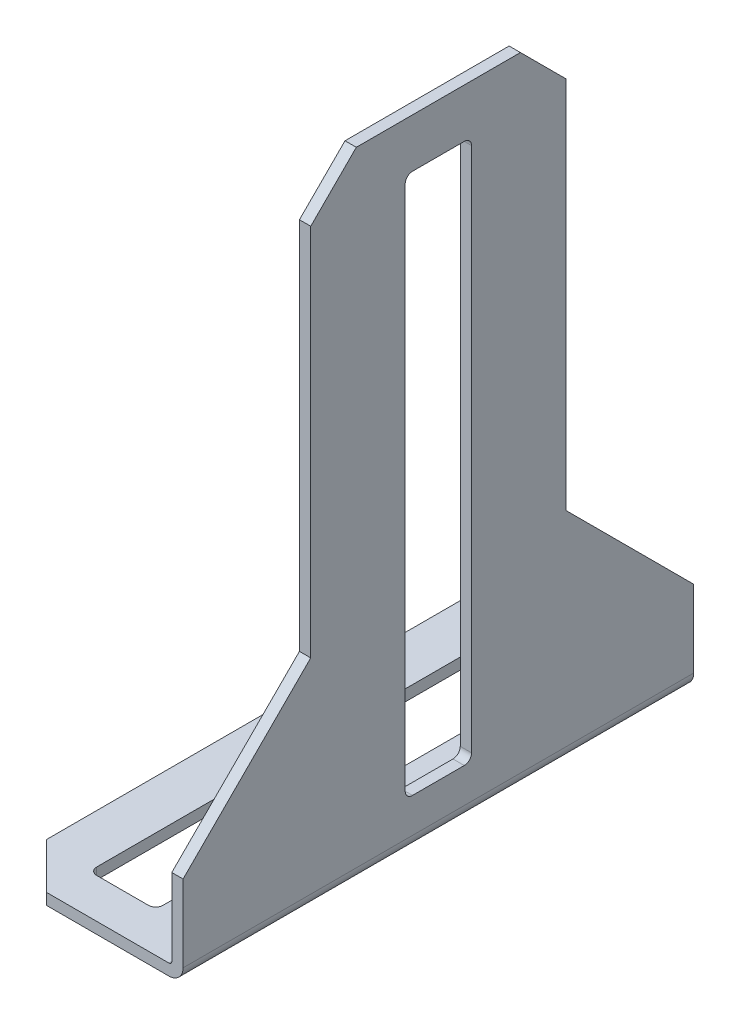
ISO-10303-21;
HEADER;
FILE_DESCRIPTION(('STEP AP214'),'2;1');
FILE_NAME('part.step','',(''),(''),'','','');
FILE_SCHEMA(('AUTOMOTIVE_DESIGN { 1 0 10303 214 1 1 1 1 }'));
ENDSEC;
DATA;
#1=APPLICATION_CONTEXT('core data for automotive mechanical design processes');
#2=APPLICATION_PROTOCOL_DEFINITION('international standard','automotive_design',2000,#1);
#3=PRODUCT_CONTEXT('',#1,'mechanical');
#4=PRODUCT('Part','Part','',(#3));
#5=PRODUCT_RELATED_PRODUCT_CATEGORY('part','',(#4));
#6=PRODUCT_DEFINITION_FORMATION('','',#4);
#7=PRODUCT_DEFINITION_CONTEXT('part definition',#1,'design');
#8=PRODUCT_DEFINITION('design','',#6,#7);
#9=PRODUCT_DEFINITION_SHAPE('','',#8);
#10=(LENGTH_UNIT() NAMED_UNIT(*) SI_UNIT(.MILLI.,.METRE.));
#11=(NAMED_UNIT(*) PLANE_ANGLE_UNIT() SI_UNIT($,.RADIAN.));
#12=(NAMED_UNIT(*) SI_UNIT($,.STERADIAN.) SOLID_ANGLE_UNIT());
#13=UNCERTAINTY_MEASURE_WITH_UNIT(LENGTH_MEASURE(1.E-05),#10,'distance_accuracy_value','');
#14=(GEOMETRIC_REPRESENTATION_CONTEXT(3) GLOBAL_UNCERTAINTY_ASSIGNED_CONTEXT((#13)) GLOBAL_UNIT_ASSIGNED_CONTEXT((#10,
#11,#12)) REPRESENTATION_CONTEXT('',''));
#15=CARTESIAN_POINT('',(0.,0.,0.));
#16=DIRECTION('',(0.,0.,1.));
#17=DIRECTION('',(1.,0.,0.));
#18=AXIS2_PLACEMENT_3D('',#15,#16,#17);
#19=CARTESIAN_POINT('',(3.9116,0.878660632863688,-14.5034));
#20=DIRECTION('',(0.,-1.,0.));
#21=DIRECTION('',(0.,0.,-1.));
#22=AXIS2_PLACEMENT_3D('',#19,#20,#21);
#23=CYLINDRICAL_SURFACE('',#22,0.508);
#24=CARTESIAN_POINT('',(3.9116,0.7874,-14.5034));
#25=DIRECTION('',(0.,-1.,0.));
#26=DIRECTION('',(0.,0.,-1.));
#27=AXIS2_PLACEMENT_3D('',#24,#25,#26);
#28=CIRCLE('',#27,0.508);
#29=CARTESIAN_POINT('',(3.4036,0.7874,-14.5034));
#30=VERTEX_POINT('',#29);
#31=CARTESIAN_POINT('',(3.9116,0.7874,-15.0114));
#32=VERTEX_POINT('',#31);
#33=EDGE_CURVE('E408',#30,#32,#28,.T.);
#34=ORIENTED_EDGE('',*,*,#33,.F.);
#35=DIRECTION('',(0.,1.,0.));
#36=VECTOR('',#35,1.);
#37=CARTESIAN_POINT('',(3.4036,0.7874,-14.5034));
#38=LINE('',#37,#36);
#39=CARTESIAN_POINT('',(3.4036,0.,-14.5034));
#40=VERTEX_POINT('',#39);
#41=EDGE_CURVE('E472',#30,#40,#38,.F.);
#42=ORIENTED_EDGE('',*,*,#41,.T.);
#43=CARTESIAN_POINT('',(3.9116,0.,-14.5034));
#44=DIRECTION('',(0.,-1.,0.));
#45=DIRECTION('',(0.,0.,-1.));
#46=AXIS2_PLACEMENT_3D('',#43,#44,#45);
#47=CIRCLE('',#46,0.508);
#48=CARTESIAN_POINT('',(3.9116,0.,-15.0114));
#49=VERTEX_POINT('',#48);
#50=EDGE_CURVE('E386',#49,#40,#47,.F.);
#51=ORIENTED_EDGE('',*,*,#50,.F.);
#52=DIRECTION('',(0.,1.,0.));
#53=VECTOR('',#52,1.);
#54=CARTESIAN_POINT('',(3.9116,0.7874,-15.0114));
#55=LINE('',#54,#53);
#56=EDGE_CURVE('E456',#49,#32,#55,.T.);
#57=ORIENTED_EDGE('',*,*,#56,.T.);
#58=EDGE_LOOP('',(#34,#42,#51,#57));
#59=FACE_BOUND('',#58,.T.);
#60=ADVANCED_FACE('F15',(#59),#23,.F.);
#61=CARTESIAN_POINT('',(3.4036,0.7874,-15.0114));
#62=DIRECTION('',(-1.,0.,0.));
#63=DIRECTION('',(0.,0.,1.));
#64=AXIS2_PLACEMENT_3D('',#61,#62,#63);
#65=PLANE('',#64);
#66=DIRECTION('',(0.,0.,-1.));
#67=VECTOR('',#66,1.);
#68=CARTESIAN_POINT('',(3.4036,0.,-17.78));
#69=LINE('',#68,#67);
#70=CARTESIAN_POINT('',(3.4036,0.,14.5034));
#71=VERTEX_POINT('',#70);
#72=EDGE_CURVE('E383',#40,#71,#69,.F.);
#73=ORIENTED_EDGE('',*,*,#72,.F.);
#74=ORIENTED_EDGE('',*,*,#41,.F.);
#75=DIRECTION('',(0.,0.,1.));
#76=VECTOR('',#75,1.);
#77=CARTESIAN_POINT('',(3.4036,0.7874,-17.78));
#78=LINE('',#77,#76);
#79=CARTESIAN_POINT('',(3.4036,0.7874,14.5034));
#80=VERTEX_POINT('',#79);
#81=EDGE_CURVE('E392',#80,#30,#78,.F.);
#82=ORIENTED_EDGE('',*,*,#81,.F.);
#83=DIRECTION('',(0.,-1.,0.));
#84=VECTOR('',#83,1.);
#85=CARTESIAN_POINT('',(3.4036,0.878660632863688,14.5034));
#86=LINE('',#85,#84);
#87=EDGE_CURVE('E470',#80,#71,#86,.T.);
#88=ORIENTED_EDGE('',*,*,#87,.T.);
#89=EDGE_LOOP('',(#73,#74,#82,#88));
#90=FACE_BOUND('',#89,.T.);
#91=ADVANCED_FACE('F806',(#90),#65,.F.);
#92=CARTESIAN_POINT('',(3.9116,0.878660632863688,14.5034));
#93=DIRECTION('',(0.,-1.,0.));
#94=DIRECTION('',(0.,0.,-1.));
#95=AXIS2_PLACEMENT_3D('',#92,#93,#94);
#96=CYLINDRICAL_SURFACE('',#95,0.508);
#97=CARTESIAN_POINT('',(3.9116,0.7874,14.5034));
#98=DIRECTION('',(0.,-1.,0.));
#99=DIRECTION('',(0.,0.,-1.));
#100=AXIS2_PLACEMENT_3D('',#97,#98,#99);
#101=CIRCLE('',#100,0.508);
#102=CARTESIAN_POINT('',(3.9116,0.7874,15.0114));
#103=VERTEX_POINT('',#102);
#104=EDGE_CURVE('E396',#103,#80,#101,.T.);
#105=ORIENTED_EDGE('',*,*,#104,.F.);
#106=DIRECTION('',(0.,1.,0.));
#107=VECTOR('',#106,1.);
#108=CARTESIAN_POINT('',(3.9116,0.7874,15.0114));
#109=LINE('',#108,#107);
#110=CARTESIAN_POINT('',(3.9116,0.,15.0114));
#111=VERTEX_POINT('',#110);
#112=EDGE_CURVE('E468',#103,#111,#109,.F.);
#113=ORIENTED_EDGE('',*,*,#112,.T.);
#114=CARTESIAN_POINT('',(3.9116,0.,14.5034));
#115=DIRECTION('',(0.,-1.,0.));
#116=DIRECTION('',(0.,0.,-1.));
#117=AXIS2_PLACEMENT_3D('',#114,#115,#116);
#118=CIRCLE('',#117,0.508);
#119=EDGE_CURVE('E382',#71,#111,#118,.F.);
#120=ORIENTED_EDGE('',*,*,#119,.F.);
#121=ORIENTED_EDGE('',*,*,#87,.F.);
#122=EDGE_LOOP('',(#105,#113,#120,#121));
#123=FACE_BOUND('',#122,.T.);
#124=ADVANCED_FACE('F798',(#123),#96,.F.);
#125=CARTESIAN_POINT('',(3.4036,0.7874,15.0114));
#126=DIRECTION('',(0.,0.,1.));
#127=DIRECTION('',(1.,0.,0.));
#128=AXIS2_PLACEMENT_3D('',#125,#126,#127);
#129=PLANE('',#128);
#130=DIRECTION('',(1.,0.,0.));
#131=VECTOR('',#130,1.);
#132=CARTESIAN_POINT('',(0.,0.,15.0114));
#133=LINE('',#132,#131);
#134=CARTESIAN_POINT('',(7.5184,0.,15.0114));
#135=VERTEX_POINT('',#134);
#136=EDGE_CURVE('E379',#111,#135,#133,.T.);
#137=ORIENTED_EDGE('',*,*,#136,.F.);
#138=ORIENTED_EDGE('',*,*,#112,.F.);
#139=DIRECTION('',(1.,0.,0.));
#140=VECTOR('',#139,1.);
#141=CARTESIAN_POINT('',(11.9126,0.7874,15.0114));
#142=LINE('',#141,#140);
#143=CARTESIAN_POINT('',(7.5184,0.7874,15.0114));
#144=VERTEX_POINT('',#143);
#145=EDGE_CURVE('E397',#144,#103,#142,.F.);
#146=ORIENTED_EDGE('',*,*,#145,.F.);
#147=DIRECTION('',(0.,-1.,0.));
#148=VECTOR('',#147,1.);
#149=CARTESIAN_POINT('',(7.5184,0.878660632863688,15.0114));
#150=LINE('',#149,#148);
#151=EDGE_CURVE('E466',#144,#135,#150,.T.);
#152=ORIENTED_EDGE('',*,*,#151,.T.);
#153=EDGE_LOOP('',(#137,#138,#146,#152));
#154=FACE_BOUND('',#153,.T.);
#155=ADVANCED_FACE('F790',(#154),#129,.F.);
#156=CARTESIAN_POINT('',(7.5184,0.878660632863688,14.5034));
#157=DIRECTION('',(0.,-1.,0.));
#158=DIRECTION('',(0.,0.,-1.));
#159=AXIS2_PLACEMENT_3D('',#156,#157,#158);
#160=CYLINDRICAL_SURFACE('',#159,0.508);
#161=CARTESIAN_POINT('',(7.5184,0.7874,14.5034));
#162=DIRECTION('',(0.,-1.,0.));
#163=DIRECTION('',(0.,0.,-1.));
#164=AXIS2_PLACEMENT_3D('',#161,#162,#163);
#165=CIRCLE('',#164,0.508);
#166=CARTESIAN_POINT('',(8.0264,0.7874,14.5034));
#167=VERTEX_POINT('',#166);
#168=EDGE_CURVE('E400',#167,#144,#165,.T.);
#169=ORIENTED_EDGE('',*,*,#168,.F.);
#170=DIRECTION('',(0.,1.,0.));
#171=VECTOR('',#170,1.);
#172=CARTESIAN_POINT('',(8.0264,0.7874,14.5034));
#173=LINE('',#172,#171);
#174=CARTESIAN_POINT('',(8.0264,0.,14.5034));
#175=VERTEX_POINT('',#174);
#176=EDGE_CURVE('E464',#167,#175,#173,.F.);
#177=ORIENTED_EDGE('',*,*,#176,.T.);
#178=CARTESIAN_POINT('',(7.5184,0.,14.5034));
#179=DIRECTION('',(0.,-1.,0.));
#180=DIRECTION('',(0.,0.,-1.));
#181=AXIS2_PLACEMENT_3D('',#178,#179,#180);
#182=CIRCLE('',#181,0.508);
#183=EDGE_CURVE('E378',#135,#175,#182,.F.);
#184=ORIENTED_EDGE('',*,*,#183,.F.);
#185=ORIENTED_EDGE('',*,*,#151,.F.);
#186=EDGE_LOOP('',(#169,#177,#184,#185));
#187=FACE_BOUND('',#186,.T.);
#188=ADVANCED_FACE('F782',(#187),#160,.F.);
#189=CARTESIAN_POINT('',(8.0264,0.7874,15.0114));
#190=DIRECTION('',(1.,0.,0.));
#191=DIRECTION('',(0.,0.,-1.));
#192=AXIS2_PLACEMENT_3D('',#189,#190,#191);
#193=PLANE('',#192);
#194=DIRECTION('',(0.,0.,1.));
#195=VECTOR('',#194,1.);
#196=CARTESIAN_POINT('',(8.0264,0.7874,-17.78));
#197=LINE('',#196,#195);
#198=CARTESIAN_POINT('',(8.0264,0.7874,-14.5034));
#199=VERTEX_POINT('',#198);
#200=EDGE_CURVE('E401',#199,#167,#197,.T.);
#201=ORIENTED_EDGE('',*,*,#200,.F.);
#202=DIRECTION('',(0.,-1.,0.));
#203=VECTOR('',#202,1.);
#204=CARTESIAN_POINT('',(8.0264,0.878660632863688,-14.5034));
#205=LINE('',#204,#203);
#206=CARTESIAN_POINT('',(8.0264,0.,-14.5034));
#207=VERTEX_POINT('',#206);
#208=EDGE_CURVE('E461',#199,#207,#205,.T.);
#209=ORIENTED_EDGE('',*,*,#208,.T.);
#210=DIRECTION('',(0.,0.,-1.));
#211=VECTOR('',#210,1.);
#212=CARTESIAN_POINT('',(8.0264,0.,-17.78));
#213=LINE('',#212,#211);
#214=EDGE_CURVE('E375',#175,#207,#213,.T.);
#215=ORIENTED_EDGE('',*,*,#214,.F.);
#216=ORIENTED_EDGE('',*,*,#176,.F.);
#217=EDGE_LOOP('',(#201,#209,#215,#216));
#218=FACE_BOUND('',#217,.T.);
#219=ADVANCED_FACE('F774',(#218),#193,.F.);
#220=CARTESIAN_POINT('',(7.5184,0.878660632863688,-14.5034));
#221=DIRECTION('',(0.,-1.,0.));
#222=DIRECTION('',(0.,0.,-1.));
#223=AXIS2_PLACEMENT_3D('',#220,#221,#222);
#224=CYLINDRICAL_SURFACE('',#223,0.508);
#225=CARTESIAN_POINT('',(7.5184,0.7874,-14.5034));
#226=DIRECTION('',(0.,-1.,0.));
#227=DIRECTION('',(0.,0.,-1.));
#228=AXIS2_PLACEMENT_3D('',#225,#226,#227);
#229=CIRCLE('',#228,0.508);
#230=CARTESIAN_POINT('',(7.5184,0.7874,-15.0114));
#231=VERTEX_POINT('',#230);
#232=EDGE_CURVE('E404',#231,#199,#229,.T.);
#233=ORIENTED_EDGE('',*,*,#232,.F.);
#234=DIRECTION('',(0.,1.,0.));
#235=VECTOR('',#234,1.);
#236=CARTESIAN_POINT('',(7.5184,0.7874,-15.0114));
#237=LINE('',#236,#235);
#238=CARTESIAN_POINT('',(7.5184,0.,-15.0114));
#239=VERTEX_POINT('',#238);
#240=EDGE_CURVE('E459',#231,#239,#237,.F.);
#241=ORIENTED_EDGE('',*,*,#240,.T.);
#242=CARTESIAN_POINT('',(7.5184,0.,-14.5034));
#243=DIRECTION('',(0.,-1.,0.));
#244=DIRECTION('',(0.,0.,-1.));
#245=AXIS2_PLACEMENT_3D('',#242,#243,#244);
#246=CIRCLE('',#245,0.508);
#247=EDGE_CURVE('E374',#207,#239,#246,.F.);
#248=ORIENTED_EDGE('',*,*,#247,.F.);
#249=ORIENTED_EDGE('',*,*,#208,.F.);
#250=EDGE_LOOP('',(#233,#241,#248,#249));
#251=FACE_BOUND('',#250,.T.);
#252=ADVANCED_FACE('F766',(#251),#224,.F.);
#253=CARTESIAN_POINT('',(8.0264,0.7874,-15.0114));
#254=DIRECTION('',(0.,0.,-1.));
#255=DIRECTION('',(-1.,0.,0.));
#256=AXIS2_PLACEMENT_3D('',#253,#254,#255);
#257=PLANE('',#256);
#258=DIRECTION('',(1.,0.,0.));
#259=VECTOR('',#258,1.);
#260=CARTESIAN_POINT('',(0.,0.,-15.0114));
#261=LINE('',#260,#259);
#262=EDGE_CURVE('E370',#239,#49,#261,.F.);
#263=ORIENTED_EDGE('',*,*,#262,.F.);
#264=ORIENTED_EDGE('',*,*,#240,.F.);
#265=DIRECTION('',(1.,0.,0.));
#266=VECTOR('',#265,1.);
#267=CARTESIAN_POINT('',(11.9126,0.7874,-15.0114));
#268=LINE('',#267,#266);
#269=EDGE_CURVE('E405',#32,#231,#268,.T.);
#270=ORIENTED_EDGE('',*,*,#269,.F.);
#271=ORIENTED_EDGE('',*,*,#56,.F.);
#272=EDGE_LOOP('',(#263,#264,#270,#271));
#273=FACE_BOUND('',#272,.T.);
#274=ADVANCED_FACE('F758',(#273),#257,.F.);
#275=CARTESIAN_POINT('',(0.,0.7874,-17.78));
#276=DIRECTION('',(-1.,0.,0.));
#277=DIRECTION('',(0.,0.,1.));
#278=AXIS2_PLACEMENT_3D('',#275,#276,#277);
#279=PLANE('',#278);
#280=DIRECTION('',(0.,0.,-1.));
#281=VECTOR('',#280,1.);
#282=CARTESIAN_POINT('',(0.,0.,-17.78));
#283=LINE('',#282,#281);
#284=CARTESIAN_POINT('',(0.,0.,14.605));
#285=VERTEX_POINT('',#284);
#286=CARTESIAN_POINT('',(0.,0.,-14.605));
#287=VERTEX_POINT('',#286);
#288=EDGE_CURVE('E373',#285,#287,#283,.T.);
#289=ORIENTED_EDGE('',*,*,#288,.F.);
#290=DIRECTION('',(0.,1.,0.));
#291=VECTOR('',#290,1.);
#292=CARTESIAN_POINT('',(0.,0.3937,14.605));
#293=LINE('',#292,#291);
#294=CARTESIAN_POINT('',(0.,0.7874,14.605));
#295=VERTEX_POINT('',#294);
#296=EDGE_CURVE('E439',#295,#285,#293,.F.);
#297=ORIENTED_EDGE('',*,*,#296,.F.);
#298=DIRECTION('',(0.,0.,1.));
#299=VECTOR('',#298,1.);
#300=CARTESIAN_POINT('',(0.,0.7874,-17.78));
#301=LINE('',#300,#299);
#302=CARTESIAN_POINT('',(0.,0.7874,-14.605));
#303=VERTEX_POINT('',#302);
#304=EDGE_CURVE('E413',#303,#295,#301,.T.);
#305=ORIENTED_EDGE('',*,*,#304,.F.);
#306=DIRECTION('',(0.,1.,0.));
#307=VECTOR('',#306,1.);
#308=CARTESIAN_POINT('',(0.,0.3937,-14.605));
#309=LINE('',#308,#307);
#310=EDGE_CURVE('E452',#287,#303,#309,.T.);
#311=ORIENTED_EDGE('',*,*,#310,.F.);
#312=EDGE_LOOP('',(#289,#297,#305,#311));
#313=FACE_BOUND('',#312,.T.);
#314=ADVANCED_FACE('F750',(#313),#279,.T.);
#315=CARTESIAN_POINT('',(1.5875,0.3937,-16.1925));
#316=DIRECTION('',(-0.707106781186548,0.,-0.707106781186548));
#317=DIRECTION('',(-0.707106781186548,0.,0.707106781186548));
#318=AXIS2_PLACEMENT_3D('',#315,#316,#317);
#319=PLANE('',#318);
#320=DIRECTION('',(0.,1.,0.));
#321=VECTOR('',#320,1.);
#322=CARTESIAN_POINT('',(3.175,0.3937,-17.78));
#323=LINE('',#322,#321);
#324=CARTESIAN_POINT('',(3.175,0.7874,-17.78));
#325=VERTEX_POINT('',#324);
#326=CARTESIAN_POINT('',(3.175,0.,-17.78));
#327=VERTEX_POINT('',#326);
#328=EDGE_CURVE('E444',#325,#327,#323,.F.);
#329=ORIENTED_EDGE('',*,*,#328,.T.);
#330=DIRECTION('',(0.707106781186547,0.,-0.707106781186548));
#331=VECTOR('',#330,1.);
#332=CARTESIAN_POINT('',(0.,0.,-14.605));
#333=LINE('',#332,#331);
#334=EDGE_CURVE('E387',#287,#327,#333,.T.);
#335=ORIENTED_EDGE('',*,*,#334,.F.);
#336=ORIENTED_EDGE('',*,*,#310,.T.);
#337=DIRECTION('',(-0.707106781186547,0.,0.707106781186548));
#338=VECTOR('',#337,1.);
#339=CARTESIAN_POINT('',(3.175,0.7874,-17.78));
#340=LINE('',#339,#338);
#341=EDGE_CURVE('E395',#325,#303,#340,.T.);
#342=ORIENTED_EDGE('',*,*,#341,.F.);
#343=EDGE_LOOP('',(#329,#335,#336,#342));
#344=FACE_BOUND('',#343,.T.);
#345=ADVANCED_FACE('F743',(#344),#319,.T.);
#346=CARTESIAN_POINT('',(1.5875,0.3937,16.1925));
#347=DIRECTION('',(-0.707106781186548,0.,0.707106781186548));
#348=DIRECTION('',(0.707106781186548,0.,0.707106781186548));
#349=AXIS2_PLACEMENT_3D('',#346,#347,#348);
#350=PLANE('',#349);
#351=DIRECTION('',(0.,1.,0.));
#352=VECTOR('',#351,1.);
#353=CARTESIAN_POINT('',(3.175,0.3937,17.78));
#354=LINE('',#353,#352);
#355=CARTESIAN_POINT('',(3.175,0.,17.78));
#356=VERTEX_POINT('',#355);
#357=CARTESIAN_POINT('',(3.175,0.7874,17.78));
#358=VERTEX_POINT('',#357);
#359=EDGE_CURVE('E232',#356,#358,#354,.T.);
#360=ORIENTED_EDGE('',*,*,#359,.T.);
#361=DIRECTION('',(0.707106781186549,0.,0.707106781186546));
#362=VECTOR('',#361,1.);
#363=CARTESIAN_POINT('',(0.,0.7874,14.605));
#364=LINE('',#363,#362);
#365=EDGE_CURVE('E410',#295,#358,#364,.T.);
#366=ORIENTED_EDGE('',*,*,#365,.F.);
#367=ORIENTED_EDGE('',*,*,#296,.T.);
#368=DIRECTION('',(-0.707106781186548,0.,-0.707106781186547));
#369=VECTOR('',#368,1.);
#370=CARTESIAN_POINT('',(3.175,0.,17.78));
#371=LINE('',#370,#369);
#372=EDGE_CURVE('E242',#356,#285,#371,.T.);
#373=ORIENTED_EDGE('',*,*,#372,.F.);
#374=EDGE_LOOP('',(#360,#366,#367,#373));
#375=FACE_BOUND('',#374,.T.);
#376=ADVANCED_FACE('F529',(#375),#350,.T.);
#377=CARTESIAN_POINT('',(11.7094,0.9906,-17.8579774517918));
#378=DIRECTION('',(0.,0.,1.));
#379=DIRECTION('',(1.,0.,0.));
#380=AXIS2_PLACEMENT_3D('',#377,#378,#379);
#381=CYLINDRICAL_SURFACE('',#380,0.203200000000001);
#382=CARTESIAN_POINT('',(11.7094,0.9906,-17.78));
#383=DIRECTION('',(0.,0.,1.));
#384=DIRECTION('',(1.,0.,0.));
#385=AXIS2_PLACEMENT_3D('',#382,#383,#384);
#386=CIRCLE('',#385,0.203200000000001);
#387=CARTESIAN_POINT('',(11.7094,0.7874,-17.78));
#388=VERTEX_POINT('',#387);
#389=CARTESIAN_POINT('',(11.9126,0.990600000000001,-17.78));
#390=VERTEX_POINT('',#389);
#391=EDGE_CURVE('E231',#388,#390,#386,.T.);
#392=ORIENTED_EDGE('',*,*,#391,.F.);
#393=DIRECTION('',(0.,0.,1.));
#394=VECTOR('',#393,1.);
#395=CARTESIAN_POINT('',(11.7094,0.7874,-17.78));
#396=LINE('',#395,#394);
#397=CARTESIAN_POINT('',(11.7094,0.7874,17.78));
#398=VERTEX_POINT('',#397);
#399=EDGE_CURVE('E226',#398,#388,#396,.F.);
#400=ORIENTED_EDGE('',*,*,#399,.F.);
#401=CARTESIAN_POINT('',(11.7094,0.9906,17.78));
#402=DIRECTION('',(0.,0.,1.));
#403=DIRECTION('',(1.,0.,0.));
#404=AXIS2_PLACEMENT_3D('',#401,#402,#403);
#405=CIRCLE('',#404,0.203200000000001);
#406=CARTESIAN_POINT('',(11.9126,0.990600000000001,17.78));
#407=VERTEX_POINT('',#406);
#408=EDGE_CURVE('E18',#407,#398,#405,.F.);
#409=ORIENTED_EDGE('',*,*,#408,.F.);
#410=DIRECTION('',(0.,0.,1.));
#411=VECTOR('',#410,1.);
#412=CARTESIAN_POINT('',(11.9126,0.990600000000001,-17.78));
#413=LINE('',#412,#411);
#414=EDGE_CURVE('E223',#390,#407,#413,.T.);
#415=ORIENTED_EDGE('',*,*,#414,.F.);
#416=EDGE_LOOP('',(#392,#400,#409,#415));
#417=FACE_BOUND('',#416,.T.);
#418=ADVANCED_FACE('F222',(#417),#381,.F.);
#419=CARTESIAN_POINT('',(11.9126,0.7874,-17.78));
#420=DIRECTION('',(0.,1.,0.));
#421=DIRECTION('',(0.,0.,1.));
#422=AXIS2_PLACEMENT_3D('',#419,#420,#421);
#423=PLANE('',#422);
#424=DIRECTION('',(1.,0.,0.));
#425=VECTOR('',#424,1.);
#426=CARTESIAN_POINT('',(0.,0.7874,17.78));
#427=LINE('',#426,#425);
#428=EDGE_CURVE('E262',#398,#358,#427,.F.);
#429=ORIENTED_EDGE('',*,*,#428,.F.);
#430=ORIENTED_EDGE('',*,*,#399,.T.);
#431=DIRECTION('',(1.,0.,0.));
#432=VECTOR('',#431,1.);
#433=CARTESIAN_POINT('',(0.,0.7874,-17.78));
#434=LINE('',#433,#432);
#435=EDGE_CURVE('E497',#388,#325,#434,.F.);
#436=ORIENTED_EDGE('',*,*,#435,.T.);
#437=ORIENTED_EDGE('',*,*,#341,.T.);
#438=ORIENTED_EDGE('',*,*,#304,.T.);
#439=ORIENTED_EDGE('',*,*,#365,.T.);
#440=EDGE_LOOP('',(#429,#430,#436,#437,#438,#439));
#441=FACE_BOUND('',#440,.T.);
#442=ORIENTED_EDGE('',*,*,#104,.T.);
#443=ORIENTED_EDGE('',*,*,#81,.T.);
#444=ORIENTED_EDGE('',*,*,#33,.T.);
#445=ORIENTED_EDGE('',*,*,#269,.T.);
#446=ORIENTED_EDGE('',*,*,#232,.T.);
#447=ORIENTED_EDGE('',*,*,#200,.T.);
#448=ORIENTED_EDGE('',*,*,#168,.T.);
#449=ORIENTED_EDGE('',*,*,#145,.T.);
#450=EDGE_LOOP('',(#442,#443,#444,#445,#446,#447,#448,#449));
#451=FACE_BOUND('',#450,.T.);
#452=ADVANCED_FACE('F523',(#441,#451),#423,.T.);
#453=CARTESIAN_POINT('',(0.,0.,-17.78));
#454=DIRECTION('',(0.,-1.,0.));
#455=DIRECTION('',(0.,0.,-1.));
#456=AXIS2_PLACEMENT_3D('',#453,#454,#455);
#457=PLANE('',#456);
#458=DIRECTION('',(1.,0.,0.));
#459=VECTOR('',#458,1.);
#460=CARTESIAN_POINT('',(0.,0.,17.78));
#461=LINE('',#460,#459);
#462=CARTESIAN_POINT('',(11.7094,0.,17.78));
#463=VERTEX_POINT('',#462);
#464=EDGE_CURVE('E252',#356,#463,#461,.T.);
#465=ORIENTED_EDGE('',*,*,#464,.F.);
#466=ORIENTED_EDGE('',*,*,#372,.T.);
#467=ORIENTED_EDGE('',*,*,#288,.T.);
#468=ORIENTED_EDGE('',*,*,#334,.T.);
#469=DIRECTION('',(1.,0.,0.));
#470=VECTOR('',#469,1.);
#471=CARTESIAN_POINT('',(0.,0.,-17.78));
#472=LINE('',#471,#470);
#473=CARTESIAN_POINT('',(11.7094,0.,-17.78));
#474=VERTEX_POINT('',#473);
#475=EDGE_CURVE('E494',#327,#474,#472,.T.);
#476=ORIENTED_EDGE('',*,*,#475,.T.);
#477=DIRECTION('',(0.,0.,-1.));
#478=VECTOR('',#477,1.);
#479=CARTESIAN_POINT('',(11.7094,0.,17.8712606328632));
#480=LINE('',#479,#478);
#481=EDGE_CURVE('E247',#463,#474,#480,.T.);
#482=ORIENTED_EDGE('',*,*,#481,.F.);
#483=EDGE_LOOP('',(#465,#466,#467,#468,#476,#482));
#484=FACE_BOUND('',#483,.T.);
#485=ORIENTED_EDGE('',*,*,#247,.T.);
#486=ORIENTED_EDGE('',*,*,#262,.T.);
#487=ORIENTED_EDGE('',*,*,#50,.T.);
#488=ORIENTED_EDGE('',*,*,#72,.T.);
#489=ORIENTED_EDGE('',*,*,#119,.T.);
#490=ORIENTED_EDGE('',*,*,#136,.T.);
#491=ORIENTED_EDGE('',*,*,#183,.T.);
#492=ORIENTED_EDGE('',*,*,#214,.T.);
#493=EDGE_LOOP('',(#485,#486,#487,#488,#489,#490,#491,#492));
#494=FACE_BOUND('',#493,.T.);
#495=ADVANCED_FACE('F531',(#484,#494),#457,.T.);
#496=CARTESIAN_POINT('',(11.9126,44.45,-17.78));
#497=DIRECTION('',(-1.,0.,0.));
#498=DIRECTION('',(0.,0.,1.));
#499=AXIS2_PLACEMENT_3D('',#496,#497,#498);
#500=PLANE('',#499);
#501=DIRECTION('',(0.,1.,0.));
#502=VECTOR('',#501,1.);
#503=CARTESIAN_POINT('',(11.9126,0.,17.78));
#504=LINE('',#503,#502);
#505=CARTESIAN_POINT('',(11.9126,6.35,17.78));
#506=VERTEX_POINT('',#505);
#507=EDGE_CURVE('E237',#506,#407,#504,.F.);
#508=ORIENTED_EDGE('',*,*,#507,.F.);
#509=DIRECTION('',(0.,0.707106781186548,-0.707106781186548));
#510=VECTOR('',#509,1.);
#511=CARTESIAN_POINT('',(11.9126,6.35,17.78));
#512=LINE('',#511,#510);
#513=CARTESIAN_POINT('',(11.9126,15.24,8.89));
#514=VERTEX_POINT('',#513);
#515=EDGE_CURVE('E279',#506,#514,#512,.T.);
#516=ORIENTED_EDGE('',*,*,#515,.T.);
#517=DIRECTION('',(0.,1.,0.));
#518=VECTOR('',#517,1.);
#519=CARTESIAN_POINT('',(11.9126,15.24,8.89));
#520=LINE('',#519,#518);
#521=CARTESIAN_POINT('',(11.9126,41.275,8.89));
#522=VERTEX_POINT('',#521);
#523=EDGE_CURVE('E289',#514,#522,#520,.T.);
#524=ORIENTED_EDGE('',*,*,#523,.T.);
#525=DIRECTION('',(0.,-0.707106781186548,0.707106781186548));
#526=VECTOR('',#525,1.);
#527=CARTESIAN_POINT('',(11.9126,42.8625,7.3025));
#528=LINE('',#527,#526);
#529=CARTESIAN_POINT('',(11.9126,44.45,5.715));
#530=VERTEX_POINT('',#529);
#531=EDGE_CURVE('E300',#530,#522,#528,.T.);
#532=ORIENTED_EDGE('',*,*,#531,.F.);
#533=DIRECTION('',(0.,0.,1.));
#534=VECTOR('',#533,1.);
#535=CARTESIAN_POINT('',(11.9126,44.45,-17.78));
#536=LINE('',#535,#534);
#537=CARTESIAN_POINT('',(11.9126,44.45,-5.715));
#538=VERTEX_POINT('',#537);
#539=EDGE_CURVE('E301',#538,#530,#536,.T.);
#540=ORIENTED_EDGE('',*,*,#539,.F.);
#541=DIRECTION('',(0.,0.707106781186548,0.707106781186548));
#542=VECTOR('',#541,1.);
#543=CARTESIAN_POINT('',(11.9126,42.8625,-7.3025));
#544=LINE('',#543,#542);
#545=CARTESIAN_POINT('',(11.9126,41.275,-8.89));
#546=VERTEX_POINT('',#545);
#547=EDGE_CURVE('E313',#546,#538,#544,.T.);
#548=ORIENTED_EDGE('',*,*,#547,.F.);
#549=DIRECTION('',(0.,1.,0.));
#550=VECTOR('',#549,1.);
#551=CARTESIAN_POINT('',(11.9126,44.45,-8.89));
#552=LINE('',#551,#550);
#553=CARTESIAN_POINT('',(11.9126,15.24,-8.89));
#554=VERTEX_POINT('',#553);
#555=EDGE_CURVE('E353',#546,#554,#552,.F.);
#556=ORIENTED_EDGE('',*,*,#555,.T.);
#557=DIRECTION('',(0.,-0.707106781186548,-0.707106781186548));
#558=VECTOR('',#557,1.);
#559=CARTESIAN_POINT('',(11.9126,15.24,-8.89));
#560=LINE('',#559,#558);
#561=CARTESIAN_POINT('',(11.9126,6.35,-17.78));
#562=VERTEX_POINT('',#561);
#563=EDGE_CURVE('E363',#554,#562,#560,.T.);
#564=ORIENTED_EDGE('',*,*,#563,.T.);
#565=DIRECTION('',(0.,1.,0.));
#566=VECTOR('',#565,1.);
#567=CARTESIAN_POINT('',(11.9126,0.,-17.78));
#568=LINE('',#567,#566);
#569=EDGE_CURVE('E240',#562,#390,#568,.F.);
#570=ORIENTED_EDGE('',*,*,#569,.T.);
#571=ORIENTED_EDGE('',*,*,#414,.T.);
#572=EDGE_LOOP('',(#508,#516,#524,#532,#540,#548,#556,#564,#570,#571));
#573=FACE_BOUND('',#572,.T.);
#574=CARTESIAN_POINT('',(11.9126,3.9116,1.8034));
#575=DIRECTION('',(1.,0.,0.));
#576=DIRECTION('',(0.,0.,-1.));
#577=AXIS2_PLACEMENT_3D('',#574,#575,#576);
#578=CIRCLE('',#577,0.508);
#579=CARTESIAN_POINT('',(11.9126,3.9116,2.3114));
#580=VERTEX_POINT('',#579);
#581=CARTESIAN_POINT('',(11.9126,3.4036,1.8034));
#582=VERTEX_POINT('',#581);
#583=EDGE_CURVE('E338',#580,#582,#578,.T.);
#584=ORIENTED_EDGE('',*,*,#583,.T.);
#585=DIRECTION('',(0.,0.,-1.));
#586=VECTOR('',#585,1.);
#587=CARTESIAN_POINT('',(11.9126,3.4036,-2.3114));
#588=LINE('',#587,#586);
#589=CARTESIAN_POINT('',(11.9126,3.4036,-1.8034));
#590=VERTEX_POINT('',#589);
#591=EDGE_CURVE('E341',#582,#590,#588,.T.);
#592=ORIENTED_EDGE('',*,*,#591,.T.);
#593=CARTESIAN_POINT('',(11.9126,3.9116,-1.8034));
#594=DIRECTION('',(1.,0.,0.));
#595=DIRECTION('',(0.,0.,-1.));
#596=AXIS2_PLACEMENT_3D('',#593,#594,#595);
#597=CIRCLE('',#596,0.508);
#598=CARTESIAN_POINT('',(11.9126,3.9116,-2.3114));
#599=VERTEX_POINT('',#598);
#600=EDGE_CURVE('E241',#590,#599,#597,.T.);
#601=ORIENTED_EDGE('',*,*,#600,.T.);
#602=DIRECTION('',(0.,1.,0.));
#603=VECTOR('',#602,1.);
#604=CARTESIAN_POINT('',(11.9126,41.0464,-2.3114));
#605=LINE('',#604,#603);
#606=CARTESIAN_POINT('',(11.9126,40.5384,-2.3114));
#607=VERTEX_POINT('',#606);
#608=EDGE_CURVE('E321',#599,#607,#605,.T.);
#609=ORIENTED_EDGE('',*,*,#608,.T.);
#610=CARTESIAN_POINT('',(11.9126,40.5384,-1.8034));
#611=DIRECTION('',(1.,0.,0.));
#612=DIRECTION('',(0.,0.,-1.));
#613=AXIS2_PLACEMENT_3D('',#610,#611,#612);
#614=CIRCLE('',#613,0.508);
#615=CARTESIAN_POINT('',(11.9126,41.0464,-1.8034));
#616=VERTEX_POINT('',#615);
#617=EDGE_CURVE('E326',#607,#616,#614,.T.);
#618=ORIENTED_EDGE('',*,*,#617,.T.);
#619=DIRECTION('',(0.,0.,1.));
#620=VECTOR('',#619,1.);
#621=CARTESIAN_POINT('',(11.9126,41.0464,2.3114));
#622=LINE('',#621,#620);
#623=CARTESIAN_POINT('',(11.9126,41.0464,1.8034));
#624=VERTEX_POINT('',#623);
#625=EDGE_CURVE('E329',#616,#624,#622,.T.);
#626=ORIENTED_EDGE('',*,*,#625,.T.);
#627=CARTESIAN_POINT('',(11.9126,40.5384,1.8034));
#628=DIRECTION('',(1.,0.,0.));
#629=DIRECTION('',(0.,0.,-1.));
#630=AXIS2_PLACEMENT_3D('',#627,#628,#629);
#631=CIRCLE('',#630,0.508);
#632=CARTESIAN_POINT('',(11.9126,40.5384,2.3114));
#633=VERTEX_POINT('',#632);
#634=EDGE_CURVE('E332',#624,#633,#631,.T.);
#635=ORIENTED_EDGE('',*,*,#634,.T.);
#636=DIRECTION('',(0.,1.,0.));
#637=VECTOR('',#636,1.);
#638=CARTESIAN_POINT('',(11.9126,3.4036,2.3114));
#639=LINE('',#638,#637);
#640=EDGE_CURVE('E335',#633,#580,#639,.F.);
#641=ORIENTED_EDGE('',*,*,#640,.T.);
#642=EDGE_LOOP('',(#584,#592,#601,#609,#618,#626,#635,#641));
#643=FACE_BOUND('',#642,.T.);
#644=ADVANCED_FACE('F235',(#573,#643),#500,.T.);
#645=CARTESIAN_POINT('',(11.8213393671368,3.9116,-1.8034));
#646=DIRECTION('',(1.,0.,0.));
#647=DIRECTION('',(0.,0.,-1.));
#648=AXIS2_PLACEMENT_3D('',#645,#646,#647);
#649=CYLINDRICAL_SURFACE('',#648,0.508);
#650=ORIENTED_EDGE('',*,*,#600,.F.);
#651=DIRECTION('',(1.,0.,0.));
#652=VECTOR('',#651,1.);
#653=CARTESIAN_POINT('',(11.9126,3.4036,-1.8034));
#654=LINE('',#653,#652);
#655=CARTESIAN_POINT('',(12.7,3.4036,-1.8034));
#656=VERTEX_POINT('',#655);
#657=EDGE_CURVE('E339',#590,#656,#654,.T.);
#658=ORIENTED_EDGE('',*,*,#657,.T.);
#659=CARTESIAN_POINT('',(12.7,3.9116,-1.8034));
#660=DIRECTION('',(1.,0.,0.));
#661=DIRECTION('',(0.,0.,-1.));
#662=AXIS2_PLACEMENT_3D('',#659,#660,#661);
#663=CIRCLE('',#662,0.508);
#664=CARTESIAN_POINT('',(12.7,3.9116,-2.3114));
#665=VERTEX_POINT('',#664);
#666=EDGE_CURVE('E312',#665,#656,#663,.F.);
#667=ORIENTED_EDGE('',*,*,#666,.F.);
#668=DIRECTION('',(-1.,0.,0.));
#669=VECTOR('',#668,1.);
#670=CARTESIAN_POINT('',(11.9126,3.9116,-2.3114));
#671=LINE('',#670,#669);
#672=EDGE_CURVE('E320',#665,#599,#671,.T.);
#673=ORIENTED_EDGE('',*,*,#672,.T.);
#674=EDGE_LOOP('',(#650,#658,#667,#673));
#675=FACE_BOUND('',#674,.T.);
#676=ADVANCED_FACE('F704',(#675),#649,.F.);
#677=CARTESIAN_POINT('',(11.9126,3.4036,-2.3114));
#678=DIRECTION('',(0.,-1.,0.));
#679=DIRECTION('',(0.,0.,-1.));
#680=AXIS2_PLACEMENT_3D('',#677,#678,#679);
#681=PLANE('',#680);
#682=DIRECTION('',(0.,0.,-1.));
#683=VECTOR('',#682,1.);
#684=CARTESIAN_POINT('',(12.7,3.4036,-17.78));
#685=LINE('',#684,#683);
#686=CARTESIAN_POINT('',(12.7,3.4036,1.8034));
#687=VERTEX_POINT('',#686);
#688=EDGE_CURVE('E489',#656,#687,#685,.F.);
#689=ORIENTED_EDGE('',*,*,#688,.F.);
#690=ORIENTED_EDGE('',*,*,#657,.F.);
#691=ORIENTED_EDGE('',*,*,#591,.F.);
#692=DIRECTION('',(1.,0.,0.));
#693=VECTOR('',#692,1.);
#694=CARTESIAN_POINT('',(11.8213393671368,3.4036,1.8034));
#695=LINE('',#694,#693);
#696=EDGE_CURVE('E336',#582,#687,#695,.T.);
#697=ORIENTED_EDGE('',*,*,#696,.T.);
#698=EDGE_LOOP('',(#689,#690,#691,#697));
#699=FACE_BOUND('',#698,.T.);
#700=ADVANCED_FACE('F696',(#699),#681,.F.);
#701=CARTESIAN_POINT('',(11.8213393671368,3.9116,1.8034));
#702=DIRECTION('',(1.,0.,0.));
#703=DIRECTION('',(0.,0.,-1.));
#704=AXIS2_PLACEMENT_3D('',#701,#702,#703);
#705=CYLINDRICAL_SURFACE('',#704,0.508);
#706=ORIENTED_EDGE('',*,*,#583,.F.);
#707=DIRECTION('',(1.,0.,0.));
#708=VECTOR('',#707,1.);
#709=CARTESIAN_POINT('',(11.9126,3.9116,2.3114));
#710=LINE('',#709,#708);
#711=CARTESIAN_POINT('',(12.7,3.9116,2.3114));
#712=VERTEX_POINT('',#711);
#713=EDGE_CURVE('E333',#580,#712,#710,.T.);
#714=ORIENTED_EDGE('',*,*,#713,.T.);
#715=CARTESIAN_POINT('',(12.7,3.9116,1.8034));
#716=DIRECTION('',(1.,0.,0.));
#717=DIRECTION('',(0.,0.,-1.));
#718=AXIS2_PLACEMENT_3D('',#715,#716,#717);
#719=CIRCLE('',#718,0.508);
#720=EDGE_CURVE('E486',#687,#712,#719,.F.);
#721=ORIENTED_EDGE('',*,*,#720,.F.);
#722=ORIENTED_EDGE('',*,*,#696,.F.);
#723=EDGE_LOOP('',(#706,#714,#721,#722));
#724=FACE_BOUND('',#723,.T.);
#725=ADVANCED_FACE('F688',(#724),#705,.F.);
#726=CARTESIAN_POINT('',(11.9126,3.4036,2.3114));
#727=DIRECTION('',(0.,0.,1.));
#728=DIRECTION('',(1.,0.,0.));
#729=AXIS2_PLACEMENT_3D('',#726,#727,#728);
#730=PLANE('',#729);
#731=DIRECTION('',(0.,1.,0.));
#732=VECTOR('',#731,1.);
#733=CARTESIAN_POINT('',(12.7,0.,2.3114));
#734=LINE('',#733,#732);
#735=CARTESIAN_POINT('',(12.7,40.5384,2.3114));
#736=VERTEX_POINT('',#735);
#737=EDGE_CURVE('E485',#712,#736,#734,.T.);
#738=ORIENTED_EDGE('',*,*,#737,.F.);
#739=ORIENTED_EDGE('',*,*,#713,.F.);
#740=ORIENTED_EDGE('',*,*,#640,.F.);
#741=DIRECTION('',(1.,0.,0.));
#742=VECTOR('',#741,1.);
#743=CARTESIAN_POINT('',(11.8213393671368,40.5384,2.3114));
#744=LINE('',#743,#742);
#745=EDGE_CURVE('E330',#633,#736,#744,.T.);
#746=ORIENTED_EDGE('',*,*,#745,.T.);
#747=EDGE_LOOP('',(#738,#739,#740,#746));
#748=FACE_BOUND('',#747,.T.);
#749=ADVANCED_FACE('F680',(#748),#730,.F.);
#750=CARTESIAN_POINT('',(11.8213393671368,40.5384,1.8034));
#751=DIRECTION('',(1.,0.,0.));
#752=DIRECTION('',(0.,0.,-1.));
#753=AXIS2_PLACEMENT_3D('',#750,#751,#752);
#754=CYLINDRICAL_SURFACE('',#753,0.508);
#755=ORIENTED_EDGE('',*,*,#634,.F.);
#756=DIRECTION('',(1.,0.,0.));
#757=VECTOR('',#756,1.);
#758=CARTESIAN_POINT('',(11.9126,41.0464,1.8034));
#759=LINE('',#758,#757);
#760=CARTESIAN_POINT('',(12.7,41.0464,1.8034));
#761=VERTEX_POINT('',#760);
#762=EDGE_CURVE('E327',#624,#761,#759,.T.);
#763=ORIENTED_EDGE('',*,*,#762,.T.);
#764=CARTESIAN_POINT('',(12.7,40.5384,1.8034));
#765=DIRECTION('',(1.,0.,0.));
#766=DIRECTION('',(0.,0.,-1.));
#767=AXIS2_PLACEMENT_3D('',#764,#765,#766);
#768=CIRCLE('',#767,0.508);
#769=EDGE_CURVE('E482',#736,#761,#768,.F.);
#770=ORIENTED_EDGE('',*,*,#769,.F.);
#771=ORIENTED_EDGE('',*,*,#745,.F.);
#772=EDGE_LOOP('',(#755,#763,#770,#771));
#773=FACE_BOUND('',#772,.T.);
#774=ADVANCED_FACE('F672',(#773),#754,.F.);
#775=CARTESIAN_POINT('',(11.9126,41.0464,2.3114));
#776=DIRECTION('',(0.,1.,0.));
#777=DIRECTION('',(0.,0.,1.));
#778=AXIS2_PLACEMENT_3D('',#775,#776,#777);
#779=PLANE('',#778);
#780=ORIENTED_EDGE('',*,*,#625,.F.);
#781=DIRECTION('',(1.,0.,0.));
#782=VECTOR('',#781,1.);
#783=CARTESIAN_POINT('',(11.8213393671368,41.0464,-1.8034));
#784=LINE('',#783,#782);
#785=CARTESIAN_POINT('',(12.7,41.0464,-1.8034));
#786=VERTEX_POINT('',#785);
#787=EDGE_CURVE('E324',#616,#786,#784,.T.);
#788=ORIENTED_EDGE('',*,*,#787,.T.);
#789=DIRECTION('',(0.,0.,-1.));
#790=VECTOR('',#789,1.);
#791=CARTESIAN_POINT('',(12.7,41.0464,-17.78));
#792=LINE('',#791,#790);
#793=EDGE_CURVE('E481',#761,#786,#792,.T.);
#794=ORIENTED_EDGE('',*,*,#793,.F.);
#795=ORIENTED_EDGE('',*,*,#762,.F.);
#796=EDGE_LOOP('',(#780,#788,#794,#795));
#797=FACE_BOUND('',#796,.T.);
#798=ADVANCED_FACE('F664',(#797),#779,.F.);
#799=CARTESIAN_POINT('',(11.8213393671368,40.5384,-1.8034));
#800=DIRECTION('',(1.,0.,0.));
#801=DIRECTION('',(0.,0.,-1.));
#802=AXIS2_PLACEMENT_3D('',#799,#800,#801);
#803=CYLINDRICAL_SURFACE('',#802,0.508);
#804=ORIENTED_EDGE('',*,*,#617,.F.);
#805=DIRECTION('',(-1.,0.,0.));
#806=VECTOR('',#805,1.);
#807=CARTESIAN_POINT('',(11.9126,40.5384,-2.3114));
#808=LINE('',#807,#806);
#809=CARTESIAN_POINT('',(12.7,40.5384,-2.3114));
#810=VERTEX_POINT('',#809);
#811=EDGE_CURVE('E318',#607,#810,#808,.F.);
#812=ORIENTED_EDGE('',*,*,#811,.T.);
#813=CARTESIAN_POINT('',(12.7,40.5384,-1.8034));
#814=DIRECTION('',(1.,0.,0.));
#815=DIRECTION('',(0.,0.,-1.));
#816=AXIS2_PLACEMENT_3D('',#813,#814,#815);
#817=CIRCLE('',#816,0.508);
#818=EDGE_CURVE('E478',#786,#810,#817,.F.);
#819=ORIENTED_EDGE('',*,*,#818,.F.);
#820=ORIENTED_EDGE('',*,*,#787,.F.);
#821=EDGE_LOOP('',(#804,#812,#819,#820));
#822=FACE_BOUND('',#821,.T.);
#823=ADVANCED_FACE('F656',(#822),#803,.F.);
#824=CARTESIAN_POINT('',(11.9126,41.0464,-2.3114));
#825=DIRECTION('',(0.,0.,-1.));
#826=DIRECTION('',(-1.,0.,0.));
#827=AXIS2_PLACEMENT_3D('',#824,#825,#826);
#828=PLANE('',#827);
#829=DIRECTION('',(0.,1.,0.));
#830=VECTOR('',#829,1.);
#831=CARTESIAN_POINT('',(12.7,0.,-2.3114));
#832=LINE('',#831,#830);
#833=EDGE_CURVE('E306',#810,#665,#832,.F.);
#834=ORIENTED_EDGE('',*,*,#833,.F.);
#835=ORIENTED_EDGE('',*,*,#811,.F.);
#836=ORIENTED_EDGE('',*,*,#608,.F.);
#837=ORIENTED_EDGE('',*,*,#672,.F.);
#838=EDGE_LOOP('',(#834,#835,#836,#837));
#839=FACE_BOUND('',#838,.T.);
#840=ADVANCED_FACE('F648',(#839),#828,.F.);
#841=CARTESIAN_POINT('',(12.7,44.45,-17.78));
#842=DIRECTION('',(0.,1.,0.));
#843=DIRECTION('',(0.,0.,1.));
#844=AXIS2_PLACEMENT_3D('',#841,#842,#843);
#845=PLANE('',#844);
#846=DIRECTION('',(0.,0.,-1.));
#847=VECTOR('',#846,1.);
#848=CARTESIAN_POINT('',(12.7,44.45,-17.78));
#849=LINE('',#848,#847);
#850=CARTESIAN_POINT('',(12.7,44.45,-5.715));
#851=VERTEX_POINT('',#850);
#852=CARTESIAN_POINT('',(12.7,44.45,5.715));
#853=VERTEX_POINT('',#852);
#854=EDGE_CURVE('E294',#851,#853,#849,.F.);
#855=ORIENTED_EDGE('',*,*,#854,.F.);
#856=DIRECTION('',(1.,0.,0.));
#857=VECTOR('',#856,1.);
#858=CARTESIAN_POINT('',(12.3063,44.45,-5.715));
#859=LINE('',#858,#857);
#860=EDGE_CURVE('E309',#538,#851,#859,.T.);
#861=ORIENTED_EDGE('',*,*,#860,.F.);
#862=ORIENTED_EDGE('',*,*,#539,.T.);
#863=DIRECTION('',(1.,0.,0.));
#864=VECTOR('',#863,1.);
#865=CARTESIAN_POINT('',(12.3063,44.45,5.715));
#866=LINE('',#865,#864);
#867=EDGE_CURVE('E297',#853,#530,#866,.F.);
#868=ORIENTED_EDGE('',*,*,#867,.F.);
#869=EDGE_LOOP('',(#855,#861,#862,#868));
#870=FACE_BOUND('',#869,.T.);
#871=ADVANCED_FACE('F640',(#870),#845,.T.);
#872=CARTESIAN_POINT('',(12.3063,42.8625,7.3025));
#873=DIRECTION('',(0.,0.707106781186548,0.707106781186548));
#874=DIRECTION('',(0.,-0.707106781186548,0.707106781186548));
#875=AXIS2_PLACEMENT_3D('',#872,#873,#874);
#876=PLANE('',#875);
#877=ORIENTED_EDGE('',*,*,#867,.T.);
#878=ORIENTED_EDGE('',*,*,#531,.T.);
#879=DIRECTION('',(-1.,0.,0.));
#880=VECTOR('',#879,1.);
#881=CARTESIAN_POINT('',(12.7,41.275,8.89));
#882=LINE('',#881,#880);
#883=CARTESIAN_POINT('',(12.7,41.275,8.89));
#884=VERTEX_POINT('',#883);
#885=EDGE_CURVE('E287',#522,#884,#882,.F.);
#886=ORIENTED_EDGE('',*,*,#885,.T.);
#887=DIRECTION('',(0.,-0.707106781186547,0.707106781186548));
#888=VECTOR('',#887,1.);
#889=CARTESIAN_POINT('',(12.7,44.45,5.715));
#890=LINE('',#889,#888);
#891=EDGE_CURVE('E284',#853,#884,#890,.T.);
#892=ORIENTED_EDGE('',*,*,#891,.F.);
#893=EDGE_LOOP('',(#877,#878,#886,#892));
#894=FACE_BOUND('',#893,.T.);
#895=ADVANCED_FACE('F632',(#894),#876,.T.);
#896=CARTESIAN_POINT('',(12.7,15.24,8.89));
#897=DIRECTION('',(0.,0.,-1.));
#898=DIRECTION('',(-1.,0.,0.));
#899=AXIS2_PLACEMENT_3D('',#896,#897,#898);
#900=PLANE('',#899);
#901=DIRECTION('',(0.,1.,0.));
#902=VECTOR('',#901,1.);
#903=CARTESIAN_POINT('',(12.7,0.,8.89));
#904=LINE('',#903,#902);
#905=CARTESIAN_POINT('',(12.7,15.24,8.89));
#906=VERTEX_POINT('',#905);
#907=EDGE_CURVE('E275',#884,#906,#904,.F.);
#908=ORIENTED_EDGE('',*,*,#907,.F.);
#909=ORIENTED_EDGE('',*,*,#885,.F.);
#910=ORIENTED_EDGE('',*,*,#523,.F.);
#911=DIRECTION('',(1.,0.,0.));
#912=VECTOR('',#911,1.);
#913=CARTESIAN_POINT('',(12.7,15.24,8.89));
#914=LINE('',#913,#912);
#915=EDGE_CURVE('E266',#514,#906,#914,.T.);
#916=ORIENTED_EDGE('',*,*,#915,.T.);
#917=EDGE_LOOP('',(#908,#909,#910,#916));
#918=FACE_BOUND('',#917,.T.);
#919=ADVANCED_FACE('F624',(#918),#900,.F.);
#920=CARTESIAN_POINT('',(12.7,6.35,17.78));
#921=DIRECTION('',(0.,-0.707106781186548,-0.707106781186548));
#922=DIRECTION('',(0.,0.707106781186548,-0.707106781186548));
#923=AXIS2_PLACEMENT_3D('',#920,#921,#922);
#924=PLANE('',#923);
#925=ORIENTED_EDGE('',*,*,#515,.F.);
#926=DIRECTION('',(1.,0.,0.));
#927=VECTOR('',#926,1.);
#928=CARTESIAN_POINT('',(0.,6.35,17.78));
#929=LINE('',#928,#927);
#930=CARTESIAN_POINT('',(12.7,6.35,17.78));
#931=VERTEX_POINT('',#930);
#932=EDGE_CURVE('E246',#931,#506,#929,.F.);
#933=ORIENTED_EDGE('',*,*,#932,.F.);
#934=DIRECTION('',(0.,-0.707106781186548,0.707106781186548));
#935=VECTOR('',#934,1.);
#936=CARTESIAN_POINT('',(12.7,15.24,8.89));
#937=LINE('',#936,#935);
#938=EDGE_CURVE('E271',#906,#931,#937,.T.);
#939=ORIENTED_EDGE('',*,*,#938,.F.);
#940=ORIENTED_EDGE('',*,*,#915,.F.);
#941=EDGE_LOOP('',(#925,#933,#939,#940));
#942=FACE_BOUND('',#941,.T.);
#943=ADVANCED_FACE('F617',(#942),#924,.F.);
#944=CARTESIAN_POINT('',(0.,0.,17.78));
#945=DIRECTION('',(0.,0.,1.));
#946=DIRECTION('',(1.,0.,0.));
#947=AXIS2_PLACEMENT_3D('',#944,#945,#946);
#948=PLANE('',#947);
#949=ORIENTED_EDGE('',*,*,#507,.T.);
#950=ORIENTED_EDGE('',*,*,#408,.T.);
#951=ORIENTED_EDGE('',*,*,#428,.T.);
#952=ORIENTED_EDGE('',*,*,#359,.F.);
#953=ORIENTED_EDGE('',*,*,#464,.T.);
#954=CARTESIAN_POINT('',(11.7094,0.9906,17.78));
#955=DIRECTION('',(0.,0.,-1.));
#956=DIRECTION('',(-1.,0.,0.));
#957=AXIS2_PLACEMENT_3D('',#954,#955,#956);
#958=CIRCLE('',#957,0.990599999999999);
#959=CARTESIAN_POINT('',(12.7,0.9906,17.78));
#960=VERTEX_POINT('',#959);
#961=EDGE_CURVE('E250',#960,#463,#958,.T.);
#962=ORIENTED_EDGE('',*,*,#961,.F.);
#963=DIRECTION('',(0.,1.,0.));
#964=VECTOR('',#963,1.);
#965=CARTESIAN_POINT('',(12.7,0.,17.78));
#966=LINE('',#965,#964);
#967=EDGE_CURVE('E274',#931,#960,#966,.F.);
#968=ORIENTED_EDGE('',*,*,#967,.F.);
#969=ORIENTED_EDGE('',*,*,#932,.T.);
#970=EDGE_LOOP('',(#949,#950,#951,#952,#953,#962,#968,#969));
#971=FACE_BOUND('',#970,.T.);
#972=ADVANCED_FACE('F244',(#971),#948,.T.);
#973=CARTESIAN_POINT('',(11.7094,0.9906,17.8712606328632));
#974=DIRECTION('',(0.,0.,-1.));
#975=DIRECTION('',(-1.,0.,0.));
#976=AXIS2_PLACEMENT_3D('',#973,#974,#975);
#977=CYLINDRICAL_SURFACE('',#976,0.990599999999999);
#978=DIRECTION('',(0.,0.,-1.));
#979=VECTOR('',#978,1.);
#980=CARTESIAN_POINT('',(12.7,0.9906,-17.78));
#981=LINE('',#980,#979);
#982=CARTESIAN_POINT('',(12.7,0.9906,-17.78));
#983=VERTEX_POINT('',#982);
#984=EDGE_CURVE('E545',#960,#983,#981,.T.);
#985=ORIENTED_EDGE('',*,*,#984,.F.);
#986=ORIENTED_EDGE('',*,*,#961,.T.);
#987=ORIENTED_EDGE('',*,*,#481,.T.);
#988=CARTESIAN_POINT('',(11.7094,0.9906,-17.78));
#989=DIRECTION('',(0.,0.,-1.));
#990=DIRECTION('',(-1.,0.,0.));
#991=AXIS2_PLACEMENT_3D('',#988,#989,#990);
#992=CIRCLE('',#991,0.990599999999999);
#993=EDGE_CURVE('E492',#474,#983,#992,.F.);
#994=ORIENTED_EDGE('',*,*,#993,.T.);
#995=EDGE_LOOP('',(#985,#986,#987,#994));
#996=FACE_BOUND('',#995,.T.);
#997=ADVANCED_FACE('F537',(#996),#977,.T.);
#998=CARTESIAN_POINT('',(0.,0.,-17.78));
#999=DIRECTION('',(0.,0.,1.));
#1000=DIRECTION('',(1.,0.,0.));
#1001=AXIS2_PLACEMENT_3D('',#998,#999,#1000);
#1002=PLANE('',#1001);
#1003=ORIENTED_EDGE('',*,*,#569,.F.);
#1004=DIRECTION('',(1.,0.,0.));
#1005=VECTOR('',#1004,1.);
#1006=CARTESIAN_POINT('',(12.7,6.35,-17.78));
#1007=LINE('',#1006,#1005);
#1008=CARTESIAN_POINT('',(12.7,6.35,-17.78));
#1009=VERTEX_POINT('',#1008);
#1010=EDGE_CURVE('E355',#562,#1009,#1007,.T.);
#1011=ORIENTED_EDGE('',*,*,#1010,.T.);
#1012=DIRECTION('',(0.,1.,0.));
#1013=VECTOR('',#1012,1.);
#1014=CARTESIAN_POINT('',(12.7,0.,-17.78));
#1015=LINE('',#1014,#1013);
#1016=EDGE_CURVE('E540',#983,#1009,#1015,.T.);
#1017=ORIENTED_EDGE('',*,*,#1016,.F.);
#1018=ORIENTED_EDGE('',*,*,#993,.F.);
#1019=ORIENTED_EDGE('',*,*,#475,.F.);
#1020=ORIENTED_EDGE('',*,*,#328,.F.);
#1021=ORIENTED_EDGE('',*,*,#435,.F.);
#1022=ORIENTED_EDGE('',*,*,#391,.T.);
#1023=EDGE_LOOP('',(#1003,#1011,#1017,#1018,#1019,#1020,#1021,#1022));
#1024=FACE_BOUND('',#1023,.T.);
#1025=ADVANCED_FACE('F519',(#1024),#1002,.F.);
#1026=CARTESIAN_POINT('',(12.7,15.24,-8.89));
#1027=DIRECTION('',(0.,-0.707106781186548,0.707106781186548));
#1028=DIRECTION('',(0.,-0.707106781186548,-0.707106781186548));
#1029=AXIS2_PLACEMENT_3D('',#1026,#1027,#1028);
#1030=PLANE('',#1029);
#1031=DIRECTION('',(0.,0.707106781186548,0.707106781186548));
#1032=VECTOR('',#1031,1.);
#1033=CARTESIAN_POINT('',(12.7,6.35,-17.78));
#1034=LINE('',#1033,#1032);
#1035=CARTESIAN_POINT('',(12.7,15.24,-8.89));
#1036=VERTEX_POINT('',#1035);
#1037=EDGE_CURVE('E360',#1009,#1036,#1034,.T.);
#1038=ORIENTED_EDGE('',*,*,#1037,.F.);
#1039=ORIENTED_EDGE('',*,*,#1010,.F.);
#1040=ORIENTED_EDGE('',*,*,#563,.F.);
#1041=DIRECTION('',(1.,0.,0.));
#1042=VECTOR('',#1041,1.);
#1043=CARTESIAN_POINT('',(12.7,15.24,-8.89));
#1044=LINE('',#1043,#1042);
#1045=EDGE_CURVE('E350',#554,#1036,#1044,.T.);
#1046=ORIENTED_EDGE('',*,*,#1045,.T.);
#1047=EDGE_LOOP('',(#1038,#1039,#1040,#1046));
#1048=FACE_BOUND('',#1047,.T.);
#1049=ADVANCED_FACE('F563',(#1048),#1030,.F.);
#1050=CARTESIAN_POINT('',(12.7,44.45,-8.89));
#1051=DIRECTION('',(0.,0.,1.));
#1052=DIRECTION('',(1.,0.,0.));
#1053=AXIS2_PLACEMENT_3D('',#1050,#1051,#1052);
#1054=PLANE('',#1053);
#1055=ORIENTED_EDGE('',*,*,#555,.F.);
#1056=DIRECTION('',(1.,0.,0.));
#1057=VECTOR('',#1056,1.);
#1058=CARTESIAN_POINT('',(12.3063,41.275,-8.89));
#1059=LINE('',#1058,#1057);
#1060=CARTESIAN_POINT('',(12.7,41.275,-8.89));
#1061=VERTEX_POINT('',#1060);
#1062=EDGE_CURVE('E33',#1061,#546,#1059,.F.);
#1063=ORIENTED_EDGE('',*,*,#1062,.F.);
#1064=DIRECTION('',(0.,1.,0.));
#1065=VECTOR('',#1064,1.);
#1066=CARTESIAN_POINT('',(12.7,0.,-8.89));
#1067=LINE('',#1066,#1065);
#1068=EDGE_CURVE('E24',#1036,#1061,#1067,.T.);
#1069=ORIENTED_EDGE('',*,*,#1068,.F.);
#1070=ORIENTED_EDGE('',*,*,#1045,.F.);
#1071=EDGE_LOOP('',(#1055,#1063,#1069,#1070));
#1072=FACE_BOUND('',#1071,.T.);
#1073=ADVANCED_FACE('F566',(#1072),#1054,.F.);
#1074=CARTESIAN_POINT('',(12.3063,42.8625,-7.3025));
#1075=DIRECTION('',(0.,0.707106781186548,-0.707106781186548));
#1076=DIRECTION('',(0.,0.707106781186548,0.707106781186548));
#1077=AXIS2_PLACEMENT_3D('',#1074,#1075,#1076);
#1078=PLANE('',#1077);
#1079=ORIENTED_EDGE('',*,*,#860,.T.);
#1080=DIRECTION('',(0.,0.707106781186548,0.707106781186547));
#1081=VECTOR('',#1080,1.);
#1082=CARTESIAN_POINT('',(12.7,41.275,-8.89));
#1083=LINE('',#1082,#1081);
#1084=EDGE_CURVE('E9',#1061,#851,#1083,.T.);
#1085=ORIENTED_EDGE('',*,*,#1084,.F.);
#1086=ORIENTED_EDGE('',*,*,#1062,.T.);
#1087=ORIENTED_EDGE('',*,*,#547,.T.);
#1088=EDGE_LOOP('',(#1079,#1085,#1086,#1087));
#1089=FACE_BOUND('',#1088,.T.);
#1090=ADVANCED_FACE('F569',(#1089),#1078,.T.);
#1091=CARTESIAN_POINT('',(12.7,0.,-17.78));
#1092=DIRECTION('',(1.,0.,0.));
#1093=DIRECTION('',(0.,0.,-1.));
#1094=AXIS2_PLACEMENT_3D('',#1091,#1092,#1093);
#1095=PLANE('',#1094);
#1096=ORIENTED_EDGE('',*,*,#1068,.T.);
#1097=ORIENTED_EDGE('',*,*,#1084,.T.);
#1098=ORIENTED_EDGE('',*,*,#854,.T.);
#1099=ORIENTED_EDGE('',*,*,#891,.T.);
#1100=ORIENTED_EDGE('',*,*,#907,.T.);
#1101=ORIENTED_EDGE('',*,*,#938,.T.);
#1102=ORIENTED_EDGE('',*,*,#967,.T.);
#1103=ORIENTED_EDGE('',*,*,#984,.T.);
#1104=ORIENTED_EDGE('',*,*,#1016,.T.);
#1105=ORIENTED_EDGE('',*,*,#1037,.T.);
#1106=EDGE_LOOP('',(#1096,#1097,#1098,#1099,#1100,#1101,#1102,#1103,#1104,#1105));
#1107=FACE_BOUND('',#1106,.T.);
#1108=ORIENTED_EDGE('',*,*,#818,.T.);
#1109=ORIENTED_EDGE('',*,*,#833,.T.);
#1110=ORIENTED_EDGE('',*,*,#666,.T.);
#1111=ORIENTED_EDGE('',*,*,#688,.T.);
#1112=ORIENTED_EDGE('',*,*,#720,.T.);
#1113=ORIENTED_EDGE('',*,*,#737,.T.);
#1114=ORIENTED_EDGE('',*,*,#769,.T.);
#1115=ORIENTED_EDGE('',*,*,#793,.T.);
#1116=EDGE_LOOP('',(#1108,#1109,#1110,#1111,#1112,#1113,#1114,#1115));
#1117=FACE_BOUND('',#1116,.T.);
#1118=ADVANCED_FACE('F548',(#1107,#1117),#1095,.T.);
#1119=CLOSED_SHELL('',(#60,#91,#124,#155,#188,#219,#252,#274,#314,#345,#376,#418,#452,#495,#644,
#676,#700,#725,#749,#774,#798,#823,#840,#871,#895,#919,#943,#972,#997,#1025,#1049,#1073,#1090,#1118));
#1120=MANIFOLD_SOLID_BREP('B1',#1119);
#1121=ADVANCED_BREP_SHAPE_REPRESENTATION('',(#18,#1120),#14);
#1122=SHAPE_DEFINITION_REPRESENTATION(#9,#1121);
ENDSEC;
END-ISO-10303-21;
